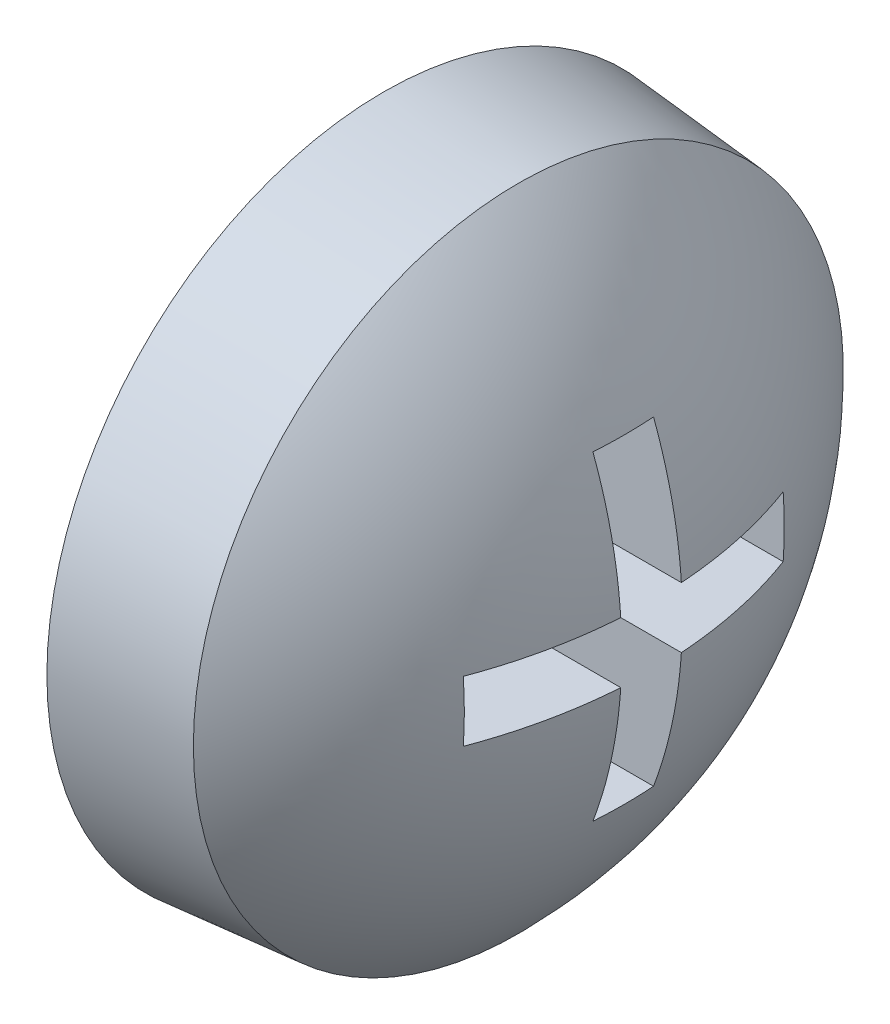
ISO-10303-21;
HEADER;
FILE_DESCRIPTION(('STEP AP214'),'2;1');
FILE_NAME('part.step','',(''),(''),'','','');
FILE_SCHEMA(('AUTOMOTIVE_DESIGN { 1 0 10303 214 1 1 1 1 }'));
ENDSEC;
DATA;
#1=APPLICATION_CONTEXT('core data for automotive mechanical design processes');
#2=APPLICATION_PROTOCOL_DEFINITION('international standard','automotive_design',2000,#1);
#3=PRODUCT_CONTEXT('',#1,'mechanical');
#4=PRODUCT('Part','Part','',(#3));
#5=PRODUCT_RELATED_PRODUCT_CATEGORY('part','',(#4));
#6=PRODUCT_DEFINITION_FORMATION('','',#4);
#7=PRODUCT_DEFINITION_CONTEXT('part definition',#1,'design');
#8=PRODUCT_DEFINITION('design','',#6,#7);
#9=PRODUCT_DEFINITION_SHAPE('','',#8);
#10=(LENGTH_UNIT() NAMED_UNIT(*) SI_UNIT(.MILLI.,.METRE.));
#11=(NAMED_UNIT(*) PLANE_ANGLE_UNIT() SI_UNIT($,.RADIAN.));
#12=(NAMED_UNIT(*) SI_UNIT($,.STERADIAN.) SOLID_ANGLE_UNIT());
#13=UNCERTAINTY_MEASURE_WITH_UNIT(LENGTH_MEASURE(1.E-05),#10,'distance_accuracy_value','');
#14=(GEOMETRIC_REPRESENTATION_CONTEXT(3) GLOBAL_UNCERTAINTY_ASSIGNED_CONTEXT((#13)) GLOBAL_UNIT_ASSIGNED_CONTEXT((#10,
#11,#12)) REPRESENTATION_CONTEXT('',''));
#15=CARTESIAN_POINT('',(0.,0.,0.));
#16=DIRECTION('',(0.,0.,1.));
#17=DIRECTION('',(1.,0.,0.));
#18=AXIS2_PLACEMENT_3D('',#15,#16,#17);
#19=CARTESIAN_POINT('',(104.166666666667,-6.9,10.));
#20=DIRECTION('',(1.,0.,0.));
#21=DIRECTION('',(0.,0.,-1.));
#22=AXIS2_PLACEMENT_3D('',#19,#20,#21);
#23=PLANE('',#22);
#24=DIRECTION('',(0.,0.,1.));
#25=VECTOR('',#24,1.);
#26=CARTESIAN_POINT('',(104.166666666667,-7.85,10.));
#27=LINE('',#26,#25);
#28=CARTESIAN_POINT('',(104.166666666667,-7.85,9.82));
#29=VERTEX_POINT('',#28);
#30=CARTESIAN_POINT('',(104.166666666667,-7.85,10.18));
#31=VERTEX_POINT('',#30);
#32=EDGE_CURVE('E293',#29,#31,#27,.T.);
#33=ORIENTED_EDGE('',*,*,#32,.F.);
#34=DIRECTION('',(0.,1.,0.));
#35=VECTOR('',#34,1.);
#36=CARTESIAN_POINT('',(104.166666666667,-6.9,9.82));
#37=LINE('',#36,#35);
#38=CARTESIAN_POINT('',(104.166666666667,-7.08,9.82));
#39=VERTEX_POINT('',#38);
#40=EDGE_CURVE('E298',#39,#29,#37,.F.);
#41=ORIENTED_EDGE('',*,*,#40,.F.);
#42=DIRECTION('',(0.,0.,1.));
#43=VECTOR('',#42,1.);
#44=CARTESIAN_POINT('',(104.166666666667,-7.08,10.));
#45=LINE('',#44,#43);
#46=CARTESIAN_POINT('',(104.166666666667,-7.08,9.05));
#47=VERTEX_POINT('',#46);
#48=EDGE_CURVE('E303',#47,#39,#45,.T.);
#49=ORIENTED_EDGE('',*,*,#48,.F.);
#50=DIRECTION('',(0.,1.,0.));
#51=VECTOR('',#50,1.);
#52=CARTESIAN_POINT('',(104.166666666667,-6.9,9.05));
#53=LINE('',#52,#51);
#54=CARTESIAN_POINT('',(104.166666666667,-6.72,9.05));
#55=VERTEX_POINT('',#54);
#56=EDGE_CURVE('E308',#55,#47,#53,.F.);
#57=ORIENTED_EDGE('',*,*,#56,.F.);
#58=DIRECTION('',(0.,0.,-1.));
#59=VECTOR('',#58,1.);
#60=CARTESIAN_POINT('',(104.166666666667,-6.72,10.));
#61=LINE('',#60,#59);
#62=CARTESIAN_POINT('',(104.166666666667,-6.72,9.82));
#63=VERTEX_POINT('',#62);
#64=EDGE_CURVE('E313',#63,#55,#61,.T.);
#65=ORIENTED_EDGE('',*,*,#64,.F.);
#66=DIRECTION('',(0.,1.,0.));
#67=VECTOR('',#66,1.);
#68=CARTESIAN_POINT('',(104.166666666667,-6.9,9.82));
#69=LINE('',#68,#67);
#70=CARTESIAN_POINT('',(104.166666666667,-5.95,9.82));
#71=VERTEX_POINT('',#70);
#72=EDGE_CURVE('E318',#71,#63,#69,.F.);
#73=ORIENTED_EDGE('',*,*,#72,.F.);
#74=DIRECTION('',(0.,0.,1.));
#75=VECTOR('',#74,1.);
#76=CARTESIAN_POINT('',(104.166666666667,-5.95,10.));
#77=LINE('',#76,#75);
#78=CARTESIAN_POINT('',(104.166666666667,-5.95,10.18));
#79=VERTEX_POINT('',#78);
#80=EDGE_CURVE('E267',#71,#79,#77,.T.);
#81=ORIENTED_EDGE('',*,*,#80,.T.);
#82=DIRECTION('',(0.,1.,0.));
#83=VECTOR('',#82,1.);
#84=CARTESIAN_POINT('',(104.166666666667,-6.9,10.18));
#85=LINE('',#84,#83);
#86=CARTESIAN_POINT('',(104.166666666667,-6.72,10.18));
#87=VERTEX_POINT('',#86);
#88=EDGE_CURVE('E264',#87,#79,#85,.T.);
#89=ORIENTED_EDGE('',*,*,#88,.F.);
#90=DIRECTION('',(0.,0.,-1.));
#91=VECTOR('',#90,1.);
#92=CARTESIAN_POINT('',(104.166666666667,-6.72,10.));
#93=LINE('',#92,#91);
#94=CARTESIAN_POINT('',(104.166666666667,-6.72,10.95));
#95=VERTEX_POINT('',#94);
#96=EDGE_CURVE('E260',#95,#87,#93,.T.);
#97=ORIENTED_EDGE('',*,*,#96,.F.);
#98=DIRECTION('',(0.,1.,0.));
#99=VECTOR('',#98,1.);
#100=CARTESIAN_POINT('',(104.166666666667,-6.9,10.95));
#101=LINE('',#100,#99);
#102=CARTESIAN_POINT('',(104.166666666667,-7.08,10.95));
#103=VERTEX_POINT('',#102);
#104=EDGE_CURVE('E231',#95,#103,#101,.F.);
#105=ORIENTED_EDGE('',*,*,#104,.T.);
#106=DIRECTION('',(0.,0.,1.));
#107=VECTOR('',#106,1.);
#108=CARTESIAN_POINT('',(104.166666666667,-7.08,10.));
#109=LINE('',#108,#107);
#110=CARTESIAN_POINT('',(104.166666666667,-7.08,10.18));
#111=VERTEX_POINT('',#110);
#112=EDGE_CURVE('E278',#111,#103,#109,.T.);
#113=ORIENTED_EDGE('',*,*,#112,.F.);
#114=DIRECTION('',(0.,1.,0.));
#115=VECTOR('',#114,1.);
#116=CARTESIAN_POINT('',(104.166666666667,-6.9,10.18));
#117=LINE('',#116,#115);
#118=EDGE_CURVE('E288',#31,#111,#117,.T.);
#119=ORIENTED_EDGE('',*,*,#118,.F.);
#120=EDGE_LOOP('',(#33,#41,#49,#57,#65,#73,#81,#89,#97,#105,#113,#119));
#121=FACE_BOUND('',#120,.T.);
#122=ADVANCED_FACE('F17',(#121),#23,.T.);
#123=CARTESIAN_POINT('',(104.766666666667,-6.72,10.));
#124=DIRECTION('',(0.,-1.,0.));
#125=DIRECTION('',(0.,0.,-1.));
#126=AXIS2_PLACEMENT_3D('',#123,#124,#125);
#127=PLANE('',#126);
#128=DIRECTION('',(1.,0.,0.));
#129=VECTOR('',#128,1.);
#130=CARTESIAN_POINT('',(104.766666666667,-6.72,10.95));
#131=LINE('',#130,#129);
#132=CARTESIAN_POINT('',(105.189571189858,-6.72,10.9499999999999));
#133=VERTEX_POINT('',#132);
#134=EDGE_CURVE('E89',#133,#95,#131,.F.);
#135=ORIENTED_EDGE('',*,*,#134,.T.);
#136=ORIENTED_EDGE('',*,*,#96,.T.);
#137=DIRECTION('',(-1.,0.,0.));
#138=VECTOR('',#137,1.);
#139=CARTESIAN_POINT('',(104.766666666667,-6.72,10.18));
#140=LINE('',#139,#138);
#141=CARTESIAN_POINT('',(105.354764236461,-6.72000000000002,10.18));
#142=VERTEX_POINT('',#141);
#143=EDGE_CURVE('E224',#142,#87,#140,.T.);
#144=ORIENTED_EDGE('',*,*,#143,.F.);
#145=CARTESIAN_POINT('',(105.189571189858,-6.72,10.9499999999998));
#146=CARTESIAN_POINT('',(105.201116204051,-6.72,10.9189995540504));
#147=CARTESIAN_POINT('',(105.212095586435,-6.72,10.8877884938066));
#148=CARTESIAN_POINT('',(105.232868784973,-6.72,10.8251104536467));
#149=CARTESIAN_POINT('',(105.242667091984,-6.72,10.7936449620739));
#150=CARTESIAN_POINT('',(105.261090632624,-6.72,10.7304618501355));
#151=CARTESIAN_POINT('',(105.269718872253,-6.72,10.6987451062671));
#152=CARTESIAN_POINT('',(105.28581062142,-6.72,10.6350619663154));
#153=CARTESIAN_POINT('',(105.293275650242,-6.72,10.6030959541241));
#154=CARTESIAN_POINT('',(105.307044828628,-6.72,10.5389148788567));
#155=CARTESIAN_POINT('',(105.313348978193,-6.72,10.5066998157807));
#156=CARTESIAN_POINT('',(105.324795725558,-6.72,10.4420201537523));
#157=CARTESIAN_POINT('',(105.329936780304,-6.72,10.4095552817085));
#158=CARTESIAN_POINT('',(105.339051828977,-6.72,10.3443751591892));
#159=CARTESIAN_POINT('',(105.343022721906,-6.72,10.3116594750372));
#160=CARTESIAN_POINT('',(105.349787708815,-6.72,10.2459761632456));
#161=CARTESIAN_POINT('',(105.352577096634,-6.72,10.2130080508537));
#162=CARTESIAN_POINT('',(105.35476423646,-6.72,10.18));
#163=B_SPLINE_CURVE_WITH_KNOTS('',3,(#145,#146,#147,#148,#149,#150,#151,#152,#153,#154,#155,
#156,#157,#158,#159,#160,#161,#162),.UNSPECIFIED.,.F.,.F.,(4,2,2,2,2,2,2,2,4),(0.,
0.0992357442434011,0.198081387639235,0.296668072480437,0.395124892694024,0.493581712907605,
0.592168397748815,0.691014041144645,0.790249785388048),.UNSPECIFIED.);
#164=EDGE_CURVE('E20',#133,#142,#163,.T.);
#165=ORIENTED_EDGE('',*,*,#164,.F.);
#166=EDGE_LOOP('',(#135,#136,#144,#165));
#167=FACE_BOUND('',#166,.T.);
#168=ADVANCED_FACE('F221',(#167),#127,.T.);
#169=CARTESIAN_POINT('',(104.766666666667,-6.9,10.18));
#170=DIRECTION('',(0.,0.,-1.));
#171=DIRECTION('',(-1.,0.,0.));
#172=AXIS2_PLACEMENT_3D('',#169,#170,#171);
#173=PLANE('',#172);
#174=ORIENTED_EDGE('',*,*,#88,.T.);
#175=DIRECTION('',(1.,0.,0.));
#176=VECTOR('',#175,1.);
#177=CARTESIAN_POINT('',(104.766666666667,-5.95,10.18));
#178=LINE('',#177,#176);
#179=CARTESIAN_POINT('',(105.189571189858,-5.95,10.18));
#180=VERTEX_POINT('',#179);
#181=EDGE_CURVE('E324',#79,#180,#178,.T.);
#182=ORIENTED_EDGE('',*,*,#181,.T.);
#183=CARTESIAN_POINT('',(105.35476423646,-6.72000000000004,10.18));
#184=CARTESIAN_POINT('',(105.349110057772,-6.63440991744423,10.18));
#185=CARTESIAN_POINT('',(105.339378570371,-6.54909652262237,10.18));
#186=CARTESIAN_POINT('',(105.312011452855,-6.3803409384024,10.18));
#187=CARTESIAN_POINT('',(105.294429898816,-6.29688998051814,10.18));
#188=CARTESIAN_POINT('',(105.249700769254,-6.12495750840968,10.18));
#189=CARTESIAN_POINT('',(105.221864706158,-6.0366546889967,10.18));
#190=CARTESIAN_POINT('',(105.189571189858,-5.95000000000018,10.18));
#191=B_SPLINE_CURVE_WITH_KNOTS('',3,(#183,#184,#185,#186,#187,#188,#189,#190),.UNSPECIFIED.,.F.,
.F.,(4,2,2,4),(0.,0.25722165882931,0.512698117737292,0.789983486231459),.UNSPECIFIED.);
#192=EDGE_CURVE('E213',#142,#180,#191,.T.);
#193=ORIENTED_EDGE('',*,*,#192,.F.);
#194=ORIENTED_EDGE('',*,*,#143,.T.);
#195=EDGE_LOOP('',(#174,#182,#193,#194));
#196=FACE_BOUND('',#195,.T.);
#197=ADVANCED_FACE('F204',(#196),#173,.T.);
#198=CARTESIAN_POINT('',(104.766666666667,-5.95,10.));
#199=DIRECTION('',(0.,1.,0.));
#200=DIRECTION('',(0.,0.,1.));
#201=AXIS2_PLACEMENT_3D('',#198,#199,#200);
#202=PLANE('',#201);
#203=ORIENTED_EDGE('',*,*,#181,.F.);
#204=ORIENTED_EDGE('',*,*,#80,.F.);
#205=DIRECTION('',(1.,0.,0.));
#206=VECTOR('',#205,1.);
#207=CARTESIAN_POINT('',(104.766666666667,-5.95,9.82));
#208=LINE('',#207,#206);
#209=CARTESIAN_POINT('',(105.189571189858,-5.95000000000009,9.82));
#210=VERTEX_POINT('',#209);
#211=EDGE_CURVE('E320',#210,#71,#208,.F.);
#212=ORIENTED_EDGE('',*,*,#211,.F.);
#213=CARTESIAN_POINT('',(105.189571189857,-5.95,10.18));
#214=CARTESIAN_POINT('',(105.193799585556,-5.94999999999998,10.12));
#215=CARTESIAN_POINT('',(105.195913783405,-5.94999999999998,10.06));
#216=CARTESIAN_POINT('',(105.195913783405,-5.95000000000002,9.93999999999997));
#217=CARTESIAN_POINT('',(105.193799585556,-5.95000000000006,9.87999999999998));
#218=CARTESIAN_POINT('',(105.189571189857,-5.95000000000011,9.81999999999998));
#219=B_SPLINE_CURVE_WITH_KNOTS('',3,(#213,#214,#215,#216,#217,#218),.UNSPECIFIED.,.F.,.F.,(4,2,
4),(0.,0.18011171114868,0.360223422297359),.UNSPECIFIED.);
#220=EDGE_CURVE('E207',#180,#210,#219,.T.);
#221=ORIENTED_EDGE('',*,*,#220,.F.);
#222=EDGE_LOOP('',(#203,#204,#212,#221));
#223=FACE_BOUND('',#222,.T.);
#224=ADVANCED_FACE('F199',(#223),#202,.F.);
#225=CARTESIAN_POINT('',(104.766666666667,-6.9,9.82));
#226=DIRECTION('',(0.,0.,1.));
#227=DIRECTION('',(1.,0.,0.));
#228=AXIS2_PLACEMENT_3D('',#225,#226,#227);
#229=PLANE('',#228);
#230=ORIENTED_EDGE('',*,*,#72,.T.);
#231=DIRECTION('',(1.,0.,0.));
#232=VECTOR('',#231,1.);
#233=CARTESIAN_POINT('',(104.766666666667,-6.72,9.82));
#234=LINE('',#233,#232);
#235=CARTESIAN_POINT('',(105.354764236461,-6.72,9.82000000000002));
#236=VERTEX_POINT('',#235);
#237=EDGE_CURVE('E315',#236,#63,#234,.F.);
#238=ORIENTED_EDGE('',*,*,#237,.F.);
#239=CARTESIAN_POINT('',(105.189571189858,-5.95000000000018,9.82));
#240=CARTESIAN_POINT('',(105.201116204051,-5.9810004459496,9.82));
#241=CARTESIAN_POINT('',(105.212095586435,-6.01221150619345,9.82));
#242=CARTESIAN_POINT('',(105.232868784973,-6.07488954635332,9.82));
#243=CARTESIAN_POINT('',(105.242667091984,-6.10635503792611,9.82));
#244=CARTESIAN_POINT('',(105.261090632624,-6.16953814986455,9.82));
#245=CARTESIAN_POINT('',(105.269718872253,-6.2012548937329,9.82));
#246=CARTESIAN_POINT('',(105.28581062142,-6.26493803368462,9.82));
#247=CARTESIAN_POINT('',(105.293275650242,-6.29690404587594,9.82));
#248=CARTESIAN_POINT('',(105.307044828628,-6.36108512114328,9.82));
#249=CARTESIAN_POINT('',(105.313348978193,-6.39330018421931,9.82));
#250=CARTESIAN_POINT('',(105.324795725559,-6.4579798462477,9.82));
#251=CARTESIAN_POINT('',(105.329936780304,-6.49044471829152,9.82));
#252=CARTESIAN_POINT('',(105.339051828977,-6.55562484081075,9.82));
#253=CARTESIAN_POINT('',(105.343022721906,-6.58834052496284,9.82));
#254=CARTESIAN_POINT('',(105.349787708815,-6.65402383675445,9.82));
#255=CARTESIAN_POINT('',(105.352577096634,-6.68699194914626,9.82));
#256=CARTESIAN_POINT('',(105.35476423646,-6.72000000000004,9.82));
#257=B_SPLINE_CURVE_WITH_KNOTS('',3,(#239,#240,#241,#242,#243,#244,#245,#246,#247,#248,#249,
#250,#251,#252,#253,#254,#255,#256),.UNSPECIFIED.,.F.,.F.,(4,2,2,2,2,2,2,2,4),(0.,
0.0992357442434019,0.198081387639235,0.296668072480437,0.395124892694024,0.493581712907604,
0.592168397748812,0.691014041144644,0.790249785388045),.UNSPECIFIED.);
#258=EDGE_CURVE('E184',#210,#236,#257,.T.);
#259=ORIENTED_EDGE('',*,*,#258,.F.);
#260=ORIENTED_EDGE('',*,*,#211,.T.);
#261=EDGE_LOOP('',(#230,#238,#259,#260));
#262=FACE_BOUND('',#261,.T.);
#263=ADVANCED_FACE('F194',(#262),#229,.T.);
#264=CARTESIAN_POINT('',(104.766666666667,-6.72,10.));
#265=DIRECTION('',(0.,-1.,0.));
#266=DIRECTION('',(0.,0.,-1.));
#267=AXIS2_PLACEMENT_3D('',#264,#265,#266);
#268=PLANE('',#267);
#269=DIRECTION('',(1.,0.,0.));
#270=VECTOR('',#269,1.);
#271=CARTESIAN_POINT('',(104.766666666667,-6.72,9.05));
#272=LINE('',#271,#270);
#273=CARTESIAN_POINT('',(105.189571189858,-6.72,9.05));
#274=VERTEX_POINT('',#273);
#275=EDGE_CURVE('E310',#274,#55,#272,.F.);
#276=ORIENTED_EDGE('',*,*,#275,.F.);
#277=CARTESIAN_POINT('',(105.35476423646,-6.72,9.82000000000004));
#278=CARTESIAN_POINT('',(105.349110057772,-6.72,9.73440991744423));
#279=CARTESIAN_POINT('',(105.339378570371,-6.72,9.64909652262237));
#280=CARTESIAN_POINT('',(105.312011452855,-6.72,9.4803409384024));
#281=CARTESIAN_POINT('',(105.294429898816,-6.72,9.39688998051814));
#282=CARTESIAN_POINT('',(105.249700769254,-6.72,9.22495750840968));
#283=CARTESIAN_POINT('',(105.221864706158,-6.72,9.1366546889967));
#284=CARTESIAN_POINT('',(105.189571189858,-6.72,9.05000000000018));
#285=B_SPLINE_CURVE_WITH_KNOTS('',3,(#277,#278,#279,#280,#281,#282,#283,#284),.UNSPECIFIED.,.F.,
.F.,(4,2,2,4),(0.,0.257221658829312,0.512698117737295,0.789983486231462),.UNSPECIFIED.);
#286=EDGE_CURVE('E176',#236,#274,#285,.T.);
#287=ORIENTED_EDGE('',*,*,#286,.F.);
#288=ORIENTED_EDGE('',*,*,#237,.T.);
#289=ORIENTED_EDGE('',*,*,#64,.T.);
#290=EDGE_LOOP('',(#276,#287,#288,#289));
#291=FACE_BOUND('',#290,.T.);
#292=ADVANCED_FACE('F191',(#291),#268,.T.);
#293=CARTESIAN_POINT('',(104.766666666667,-6.9,9.05));
#294=DIRECTION('',(0.,0.,1.));
#295=DIRECTION('',(1.,0.,0.));
#296=AXIS2_PLACEMENT_3D('',#293,#294,#295);
#297=PLANE('',#296);
#298=DIRECTION('',(1.,0.,0.));
#299=VECTOR('',#298,1.);
#300=CARTESIAN_POINT('',(104.766666666667,-7.08,9.05));
#301=LINE('',#300,#299);
#302=CARTESIAN_POINT('',(105.189571189858,-7.08,9.05000000000009));
#303=VERTEX_POINT('',#302);
#304=EDGE_CURVE('E305',#303,#47,#301,.F.);
#305=ORIENTED_EDGE('',*,*,#304,.F.);
#306=CARTESIAN_POINT('',(105.189571189858,-7.08,9.05));
#307=CARTESIAN_POINT('',(105.195913783405,-6.99011174581236,9.05));
#308=CARTESIAN_POINT('',(105.195913783405,-6.9,9.05));
#309=B_SPLINE_CURVE_WITH_KNOTS('',2,(#306,#307,#308),.UNSPECIFIED.,.F.,.F.,(3,3),(0.,1.),.UNSPECIFIED.);
#310=CARTESIAN_POINT('',(105.195913783405,-6.9,9.05));
#311=VERTEX_POINT('',#310);
#312=EDGE_CURVE('E175',#311,#303,#309,.F.);
#313=ORIENTED_EDGE('',*,*,#312,.F.);
#314=CARTESIAN_POINT('',(105.195913783405,-6.9,9.05));
#315=CARTESIAN_POINT('',(105.195913783405,-6.80988825418764,9.05));
#316=CARTESIAN_POINT('',(105.189571189858,-6.72,9.05));
#317=B_SPLINE_CURVE_WITH_KNOTS('',2,(#314,#315,#316),.UNSPECIFIED.,.F.,.F.,(3,3),(0.,1.),.UNSPECIFIED.);
#318=EDGE_CURVE('E183',#274,#311,#317,.F.);
#319=ORIENTED_EDGE('',*,*,#318,.F.);
#320=ORIENTED_EDGE('',*,*,#275,.T.);
#321=ORIENTED_EDGE('',*,*,#56,.T.);
#322=EDGE_LOOP('',(#305,#313,#319,#320,#321));
#323=FACE_BOUND('',#322,.T.);
#324=ADVANCED_FACE('F164',(#323),#297,.T.);
#325=CARTESIAN_POINT('',(104.766666666667,-7.08,10.));
#326=DIRECTION('',(0.,1.,0.));
#327=DIRECTION('',(0.,0.,1.));
#328=AXIS2_PLACEMENT_3D('',#325,#326,#327);
#329=PLANE('',#328);
#330=ORIENTED_EDGE('',*,*,#304,.T.);
#331=ORIENTED_EDGE('',*,*,#48,.T.);
#332=DIRECTION('',(1.,0.,0.));
#333=VECTOR('',#332,1.);
#334=CARTESIAN_POINT('',(104.766666666667,-7.08,9.82));
#335=LINE('',#334,#333);
#336=CARTESIAN_POINT('',(105.354764236461,-7.07999999999998,9.82));
#337=VERTEX_POINT('',#336);
#338=EDGE_CURVE('E300',#337,#39,#335,.F.);
#339=ORIENTED_EDGE('',*,*,#338,.F.);
#340=CARTESIAN_POINT('',(105.189571189858,-7.08,9.05000000000018));
#341=CARTESIAN_POINT('',(105.201116204051,-7.08,9.08100044594959));
#342=CARTESIAN_POINT('',(105.212095586435,-7.08,9.11221150619344));
#343=CARTESIAN_POINT('',(105.232868784973,-7.08,9.17488954635332));
#344=CARTESIAN_POINT('',(105.242667091984,-7.08,9.20635503792611));
#345=CARTESIAN_POINT('',(105.261090632624,-7.08,9.26953814986455));
#346=CARTESIAN_POINT('',(105.269718872253,-7.08,9.3012548937329));
#347=CARTESIAN_POINT('',(105.28581062142,-7.08,9.36493803368462));
#348=CARTESIAN_POINT('',(105.293275650242,-7.08,9.39690404587594));
#349=CARTESIAN_POINT('',(105.307044828628,-7.08,9.46108512114328));
#350=CARTESIAN_POINT('',(105.313348978193,-7.08,9.49330018421931));
#351=CARTESIAN_POINT('',(105.324795725558,-7.08,9.5579798462477));
#352=CARTESIAN_POINT('',(105.329936780304,-7.08,9.59044471829152));
#353=CARTESIAN_POINT('',(105.339051828977,-7.08,9.65562484081075));
#354=CARTESIAN_POINT('',(105.343022721906,-7.08,9.68834052496284));
#355=CARTESIAN_POINT('',(105.349787708815,-7.08,9.75402383675445));
#356=CARTESIAN_POINT('',(105.352577096634,-7.08,9.78699194914627));
#357=CARTESIAN_POINT('',(105.35476423646,-7.08,9.82000000000004));
#358=B_SPLINE_CURVE_WITH_KNOTS('',3,(#340,#341,#342,#343,#344,#345,#346,#347,#348,#349,#350,
#351,#352,#353,#354,#355,#356,#357),.UNSPECIFIED.,.F.,.F.,(4,2,2,2,2,2,2,2,4),(0.,
0.0992357442434011,0.198081387639235,0.296668072480437,0.395124892694024,0.493581712907605,
0.592168397748812,0.691014041144643,0.790249785388046),.UNSPECIFIED.);
#359=EDGE_CURVE('E168',#303,#337,#358,.T.);
#360=ORIENTED_EDGE('',*,*,#359,.F.);
#361=EDGE_LOOP('',(#330,#331,#339,#360));
#362=FACE_BOUND('',#361,.T.);
#363=ADVANCED_FACE('F159',(#362),#329,.T.);
#364=CARTESIAN_POINT('',(104.766666666667,-6.9,9.82));
#365=DIRECTION('',(0.,0.,1.));
#366=DIRECTION('',(1.,0.,0.));
#367=AXIS2_PLACEMENT_3D('',#364,#365,#366);
#368=PLANE('',#367);
#369=ORIENTED_EDGE('',*,*,#40,.T.);
#370=DIRECTION('',(1.,0.,0.));
#371=VECTOR('',#370,1.);
#372=CARTESIAN_POINT('',(104.766666666667,-7.85,9.82));
#373=LINE('',#372,#371);
#374=CARTESIAN_POINT('',(105.189571189858,-7.85,9.82000000000002));
#375=VERTEX_POINT('',#374);
#376=EDGE_CURVE('E295',#375,#29,#373,.F.);
#377=ORIENTED_EDGE('',*,*,#376,.F.);
#378=CARTESIAN_POINT('',(105.35476423646,-7.07999999999996,9.82));
#379=CARTESIAN_POINT('',(105.349110057772,-7.16559008255577,9.82));
#380=CARTESIAN_POINT('',(105.339378570371,-7.25090347737763,9.82));
#381=CARTESIAN_POINT('',(105.312011452855,-7.4196590615976,9.82));
#382=CARTESIAN_POINT('',(105.294429898816,-7.50311001948186,9.82));
#383=CARTESIAN_POINT('',(105.249700769254,-7.67504249159033,9.82));
#384=CARTESIAN_POINT('',(105.221864706158,-7.7633453110033,9.82));
#385=CARTESIAN_POINT('',(105.189571189858,-7.84999999999982,9.82));
#386=B_SPLINE_CURVE_WITH_KNOTS('',3,(#378,#379,#380,#381,#382,#383,#384,#385),.UNSPECIFIED.,.F.,
.F.,(4,2,2,4),(0.,0.257221658829311,0.512698117737293,0.789983486231459),.UNSPECIFIED.);
#387=EDGE_CURVE('E144',#337,#375,#386,.T.);
#388=ORIENTED_EDGE('',*,*,#387,.F.);
#389=ORIENTED_EDGE('',*,*,#338,.T.);
#390=EDGE_LOOP('',(#369,#377,#388,#389));
#391=FACE_BOUND('',#390,.T.);
#392=ADVANCED_FACE('F154',(#391),#368,.T.);
#393=CARTESIAN_POINT('',(104.766666666667,-7.85,10.));
#394=DIRECTION('',(0.,1.,0.));
#395=DIRECTION('',(0.,0.,1.));
#396=AXIS2_PLACEMENT_3D('',#393,#394,#395);
#397=PLANE('',#396);
#398=ORIENTED_EDGE('',*,*,#32,.T.);
#399=DIRECTION('',(-1.,0.,0.));
#400=VECTOR('',#399,1.);
#401=CARTESIAN_POINT('',(104.766666666667,-7.85,10.18));
#402=LINE('',#401,#400);
#403=CARTESIAN_POINT('',(105.189571189858,-7.84999999999991,10.18));
#404=VERTEX_POINT('',#403);
#405=EDGE_CURVE('E290',#404,#31,#402,.T.);
#406=ORIENTED_EDGE('',*,*,#405,.F.);
#407=CARTESIAN_POINT('',(105.189571189857,-7.85,9.82000000000004));
#408=CARTESIAN_POINT('',(105.193799585556,-7.85000000000001,9.88000000000003));
#409=CARTESIAN_POINT('',(105.195913783405,-7.85000000000001,9.94000000000003));
#410=CARTESIAN_POINT('',(105.195913783405,-7.84999999999999,10.06));
#411=CARTESIAN_POINT('',(105.193799585556,-7.84999999999997,10.12));
#412=CARTESIAN_POINT('',(105.189571189857,-7.84999999999994,10.18));
#413=B_SPLINE_CURVE_WITH_KNOTS('',3,(#407,#408,#409,#410,#411,#412),.UNSPECIFIED.,.F.,.F.,(4,2,
4),(0.,0.180111711148678,0.360223422297359),.UNSPECIFIED.);
#414=EDGE_CURVE('E137',#375,#404,#413,.T.);
#415=ORIENTED_EDGE('',*,*,#414,.F.);
#416=ORIENTED_EDGE('',*,*,#376,.T.);
#417=EDGE_LOOP('',(#398,#406,#415,#416));
#418=FACE_BOUND('',#417,.T.);
#419=ADVANCED_FACE('F151',(#418),#397,.T.);
#420=CARTESIAN_POINT('',(104.766666666667,-6.9,10.18));
#421=DIRECTION('',(0.,0.,-1.));
#422=DIRECTION('',(-1.,0.,0.));
#423=AXIS2_PLACEMENT_3D('',#420,#421,#422);
#424=PLANE('',#423);
#425=ORIENTED_EDGE('',*,*,#118,.T.);
#426=DIRECTION('',(1.,0.,0.));
#427=VECTOR('',#426,1.);
#428=CARTESIAN_POINT('',(104.766666666667,-7.08,10.18));
#429=LINE('',#428,#427);
#430=CARTESIAN_POINT('',(105.354764236461,-7.08,10.18));
#431=VERTEX_POINT('',#430);
#432=EDGE_CURVE('E280',#431,#111,#429,.F.);
#433=ORIENTED_EDGE('',*,*,#432,.F.);
#434=CARTESIAN_POINT('',(105.189571189858,-7.84999999999982,10.18));
#435=CARTESIAN_POINT('',(105.201116204051,-7.8189995540504,10.18));
#436=CARTESIAN_POINT('',(105.212095586435,-7.78778849380655,10.18));
#437=CARTESIAN_POINT('',(105.232868784973,-7.72511045364668,10.18));
#438=CARTESIAN_POINT('',(105.242667091984,-7.69364496207389,10.18));
#439=CARTESIAN_POINT('',(105.261090632624,-7.63046185013545,10.18));
#440=CARTESIAN_POINT('',(105.269718872253,-7.5987451062671,10.18));
#441=CARTESIAN_POINT('',(105.28581062142,-7.53506196631538,10.18));
#442=CARTESIAN_POINT('',(105.293275650242,-7.50309595412407,10.18));
#443=CARTESIAN_POINT('',(105.307044828628,-7.43891487885672,10.18));
#444=CARTESIAN_POINT('',(105.313348978193,-7.40669981578069,10.18));
#445=CARTESIAN_POINT('',(105.324795725558,-7.3420201537523,10.18));
#446=CARTESIAN_POINT('',(105.329936780304,-7.30955528170849,10.18));
#447=CARTESIAN_POINT('',(105.339051828977,-7.24437515918925,10.18));
#448=CARTESIAN_POINT('',(105.343022721906,-7.21165947503717,10.18));
#449=CARTESIAN_POINT('',(105.349787708815,-7.14597616324556,10.18));
#450=CARTESIAN_POINT('',(105.352577096634,-7.11300805085374,10.18));
#451=CARTESIAN_POINT('',(105.35476423646,-7.07999999999997,10.18));
#452=B_SPLINE_CURVE_WITH_KNOTS('',3,(#434,#435,#436,#437,#438,#439,#440,#441,#442,#443,#444,
#445,#446,#447,#448,#449,#450,#451),.UNSPECIFIED.,.F.,.F.,(4,2,2,2,2,2,2,2,4),(0.,
0.0992357442434019,0.198081387639233,0.296668072480435,0.39512489269402,0.4935817129076,
0.592168397748806,0.691014041144637,0.790249785388038),.UNSPECIFIED.);
#453=EDGE_CURVE('E100',#404,#431,#452,.T.);
#454=ORIENTED_EDGE('',*,*,#453,.F.);
#455=ORIENTED_EDGE('',*,*,#405,.T.);
#456=EDGE_LOOP('',(#425,#433,#454,#455));
#457=FACE_BOUND('',#456,.T.);
#458=ADVANCED_FACE('F123',(#457),#424,.T.);
#459=CARTESIAN_POINT('',(104.766666666667,-7.08,10.));
#460=DIRECTION('',(0.,1.,0.));
#461=DIRECTION('',(0.,0.,1.));
#462=AXIS2_PLACEMENT_3D('',#459,#460,#461);
#463=PLANE('',#462);
#464=DIRECTION('',(1.,0.,0.));
#465=VECTOR('',#464,1.);
#466=CARTESIAN_POINT('',(104.766666666667,-7.08,10.95));
#467=LINE('',#466,#465);
#468=CARTESIAN_POINT('',(105.189571189858,-7.08,10.95));
#469=VERTEX_POINT('',#468);
#470=EDGE_CURVE('E40',#103,#469,#467,.T.);
#471=ORIENTED_EDGE('',*,*,#470,.T.);
#472=CARTESIAN_POINT('',(105.35476423646,-7.08,10.18));
#473=CARTESIAN_POINT('',(105.349110057772,-7.08,10.2655900825558));
#474=CARTESIAN_POINT('',(105.339378570371,-7.08,10.3509034773776));
#475=CARTESIAN_POINT('',(105.312011452855,-7.08,10.5196590615976));
#476=CARTESIAN_POINT('',(105.294429898816,-7.08,10.6031100194819));
#477=CARTESIAN_POINT('',(105.249700769254,-7.08,10.7750424915903));
#478=CARTESIAN_POINT('',(105.221864706158,-7.08,10.8633453110033));
#479=CARTESIAN_POINT('',(105.189571189858,-7.08,10.9499999999998));
#480=B_SPLINE_CURVE_WITH_KNOTS('',3,(#472,#473,#474,#475,#476,#477,#478,#479),.UNSPECIFIED.,.F.,
.F.,(4,2,2,4),(0.,0.25722165882931,0.512698117737293,0.789983486231462),.UNSPECIFIED.);
#481=EDGE_CURVE('E96',#431,#469,#480,.T.);
#482=ORIENTED_EDGE('',*,*,#481,.F.);
#483=ORIENTED_EDGE('',*,*,#432,.T.);
#484=ORIENTED_EDGE('',*,*,#112,.T.);
#485=EDGE_LOOP('',(#471,#482,#483,#484));
#486=FACE_BOUND('',#485,.T.);
#487=ADVANCED_FACE('F115',(#486),#463,.T.);
#488=CARTESIAN_POINT('',(104.766666666667,-6.9,10.95));
#489=DIRECTION('',(0.,0.,1.));
#490=DIRECTION('',(1.,0.,0.));
#491=AXIS2_PLACEMENT_3D('',#488,#489,#490);
#492=PLANE('',#491);
#493=ORIENTED_EDGE('',*,*,#470,.F.);
#494=ORIENTED_EDGE('',*,*,#104,.F.);
#495=ORIENTED_EDGE('',*,*,#134,.F.);
#496=CARTESIAN_POINT('',(105.195913783405,-6.9,10.95));
#497=CARTESIAN_POINT('',(105.195913783405,-6.80988825418764,10.95));
#498=CARTESIAN_POINT('',(105.189571189858,-6.72,10.95));
#499=B_SPLINE_CURVE_WITH_KNOTS('',2,(#496,#497,#498),.UNSPECIFIED.,.F.,.F.,(3,3),(0.,1.),.UNSPECIFIED.);
#500=CARTESIAN_POINT('',(105.195913783405,-6.9,10.95));
#501=VERTEX_POINT('',#500);
#502=EDGE_CURVE('E82',#501,#133,#499,.T.);
#503=ORIENTED_EDGE('',*,*,#502,.F.);
#504=CARTESIAN_POINT('',(105.189571189858,-7.08,10.95));
#505=CARTESIAN_POINT('',(105.195913783405,-6.99011174581236,10.95));
#506=CARTESIAN_POINT('',(105.195913783405,-6.9,10.95));
#507=B_SPLINE_CURVE_WITH_KNOTS('',2,(#504,#505,#506),.UNSPECIFIED.,.F.,.F.,(3,3),(0.,1.),.UNSPECIFIED.);
#508=EDGE_CURVE('E85',#469,#501,#507,.T.);
#509=ORIENTED_EDGE('',*,*,#508,.F.);
#510=EDGE_LOOP('',(#493,#494,#495,#503,#509));
#511=FACE_BOUND('',#510,.T.);
#512=ADVANCED_FACE('F84',(#511),#492,.F.);
#513=CARTESIAN_POINT('',(102.63858228722,-6.9,10.));
#514=DIRECTION('',(1.,0.,0.));
#515=DIRECTION('',(0.,1.,0.));
#516=AXIS2_PLACEMENT_3D('',#513,#514,#515);
#517=SPHERICAL_SURFACE('',#516,2.72808437944638);
#518=CARTESIAN_POINT('',(104.566666666642,-6.9,10.));
#519=DIRECTION('',(-1.,0.,0.));
#520=DIRECTION('',(0.,0.,1.));
#521=AXIS2_PLACEMENT_3D('',#518,#519,#520);
#522=CIRCLE('',#521,1.93000906918229);
#523=CARTESIAN_POINT('',(104.566666666642,-6.90000000000007,11.9300090691823));
#524=VERTEX_POINT('',#523);
#525=EDGE_CURVE('E31',#524,#524,#522,.T.);
#526=ORIENTED_EDGE('',*,*,#525,.F.);
#527=EDGE_LOOP('',(#526));
#528=FACE_BOUND('',#527,.T.);
#529=ORIENTED_EDGE('',*,*,#481,.T.);
#530=ORIENTED_EDGE('',*,*,#508,.T.);
#531=ORIENTED_EDGE('',*,*,#502,.T.);
#532=ORIENTED_EDGE('',*,*,#164,.T.);
#533=ORIENTED_EDGE('',*,*,#192,.T.);
#534=ORIENTED_EDGE('',*,*,#220,.T.);
#535=ORIENTED_EDGE('',*,*,#258,.T.);
#536=ORIENTED_EDGE('',*,*,#286,.T.);
#537=ORIENTED_EDGE('',*,*,#318,.T.);
#538=ORIENTED_EDGE('',*,*,#312,.T.);
#539=ORIENTED_EDGE('',*,*,#359,.T.);
#540=ORIENTED_EDGE('',*,*,#387,.T.);
#541=ORIENTED_EDGE('',*,*,#414,.T.);
#542=ORIENTED_EDGE('',*,*,#453,.T.);
#543=EDGE_LOOP('',(#529,#530,#531,#532,#533,#534,#535,#536,#537,#538,#539,#540,#541,#542));
#544=FACE_BOUND('',#543,.T.);
#545=ADVANCED_FACE('F94',(#528,#544),#517,.T.);
#546=CARTESIAN_POINT('',(103.766666666672,-6.9,10.));
#547=DIRECTION('',(-1.,0.,0.));
#548=DIRECTION('',(0.,0.,1.));
#549=AXIS2_PLACEMENT_3D('',#546,#547,#548);
#550=CONICAL_SURFACE('',#549,2.00000000000045,0.0872664625936403);
#551=CARTESIAN_POINT('',(103.766666666672,-6.9,10.));
#552=DIRECTION('',(-1.,0.,0.));
#553=DIRECTION('',(0.,0.,1.));
#554=AXIS2_PLACEMENT_3D('',#551,#552,#553);
#555=CIRCLE('',#554,2.00000000000045);
#556=CARTESIAN_POINT('',(103.766666666672,-6.9,12.0000000000005));
#557=VERTEX_POINT('',#556);
#558=EDGE_CURVE('E11',#557,#557,#555,.T.);
#559=ORIENTED_EDGE('',*,*,#558,.F.);
#560=EDGE_LOOP('',(#559));
#561=FACE_BOUND('',#560,.T.);
#562=ORIENTED_EDGE('',*,*,#525,.T.);
#563=EDGE_LOOP('',(#562));
#564=FACE_BOUND('',#563,.T.);
#565=ADVANCED_FACE('F402',(#561,#564),#550,.T.);
#566=CARTESIAN_POINT('',(103.766666666667,-6.9,11.));
#567=DIRECTION('',(-1.,0.,0.));
#568=DIRECTION('',(0.,0.,1.));
#569=AXIS2_PLACEMENT_3D('',#566,#567,#568);
#570=PLANE('',#569);
#571=ORIENTED_EDGE('',*,*,#558,.T.);
#572=EDGE_LOOP('',(#571));
#573=FACE_BOUND('',#572,.T.);
#574=ADVANCED_FACE('F400',(#573),#570,.T.);
#575=CLOSED_SHELL('',(#122,#168,#197,#224,#263,#292,#324,#363,#392,#419,#458,#487,#512,#545,
#565,#574));
#576=MANIFOLD_SOLID_BREP('B1',#575);
#577=ADVANCED_BREP_SHAPE_REPRESENTATION('',(#18,#576),#14);
#578=SHAPE_DEFINITION_REPRESENTATION(#9,#577);
ENDSEC;
END-ISO-10303-21;
